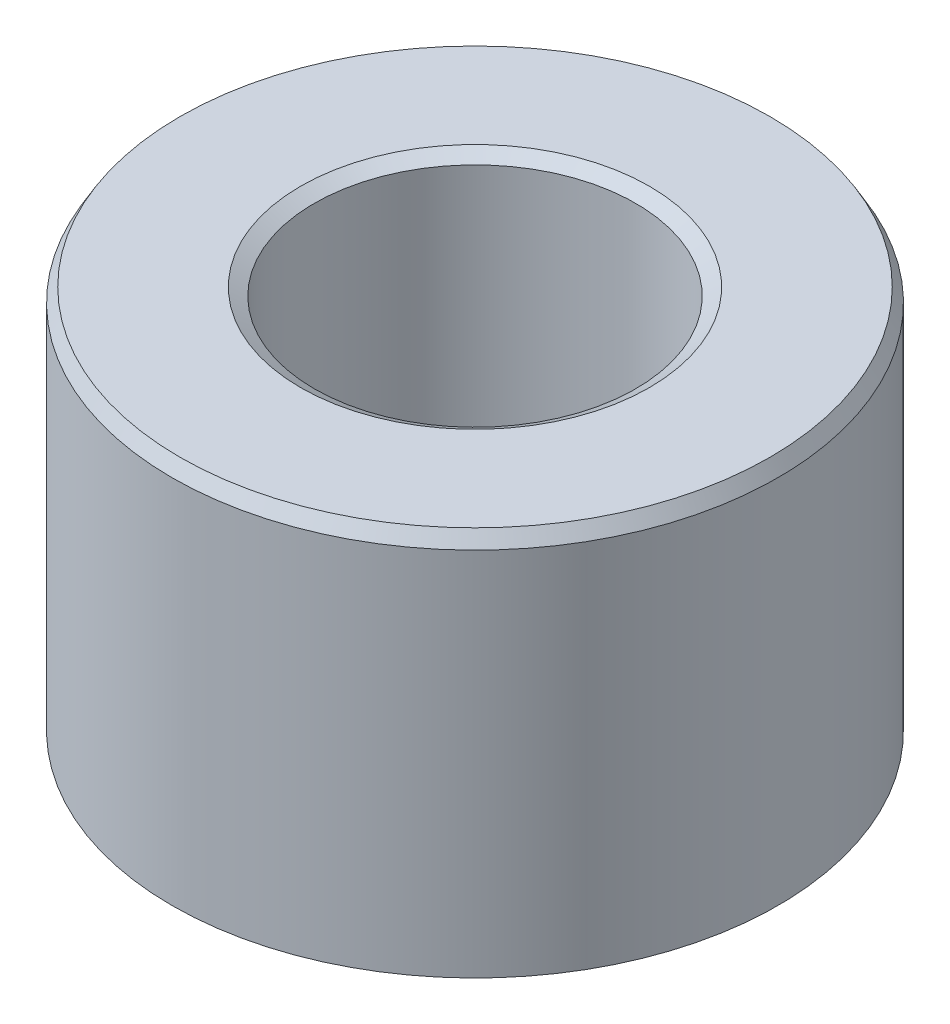
ISO-10303-21;
HEADER;
FILE_DESCRIPTION(('STEP AP214'),'2;1');
FILE_NAME('part.step','',(''),(''),'','','');
FILE_SCHEMA(('AUTOMOTIVE_DESIGN { 1 0 10303 214 1 1 1 1 }'));
ENDSEC;
DATA;
#1=APPLICATION_CONTEXT('core data for automotive mechanical design processes');
#2=APPLICATION_PROTOCOL_DEFINITION('international standard','automotive_design',2000,#1);
#3=PRODUCT_CONTEXT('',#1,'mechanical');
#4=PRODUCT('Part','Part','',(#3));
#5=PRODUCT_RELATED_PRODUCT_CATEGORY('part','',(#4));
#6=PRODUCT_DEFINITION_FORMATION('','',#4);
#7=PRODUCT_DEFINITION_CONTEXT('part definition',#1,'design');
#8=PRODUCT_DEFINITION('design','',#6,#7);
#9=PRODUCT_DEFINITION_SHAPE('','',#8);
#10=(LENGTH_UNIT() NAMED_UNIT(*) SI_UNIT(.MILLI.,.METRE.));
#11=(NAMED_UNIT(*) PLANE_ANGLE_UNIT() SI_UNIT($,.RADIAN.));
#12=(NAMED_UNIT(*) SI_UNIT($,.STERADIAN.) SOLID_ANGLE_UNIT());
#13=UNCERTAINTY_MEASURE_WITH_UNIT(LENGTH_MEASURE(1.E-05),#10,'distance_accuracy_value','');
#14=(GEOMETRIC_REPRESENTATION_CONTEXT(3) GLOBAL_UNCERTAINTY_ASSIGNED_CONTEXT((#13)) GLOBAL_UNIT_ASSIGNED_CONTEXT((#10,
#11,#12)) REPRESENTATION_CONTEXT('',''));
#15=CARTESIAN_POINT('',(0.,0.,0.));
#16=DIRECTION('',(0.,0.,1.));
#17=DIRECTION('',(1.,0.,0.));
#18=AXIS2_PLACEMENT_3D('',#15,#16,#17);
#19=CARTESIAN_POINT('',(0.,9.7087255560398,0.));
#20=DIRECTION('',(0.,-1.,0.));
#21=DIRECTION('',(0.,0.,-1.));
#22=AXIS2_PLACEMENT_3D('',#19,#20,#21);
#23=CYLINDRICAL_SURFACE('',#22,7.5);
#24=CARTESIAN_POINT('',(0.,0.196285721641992,0.));
#25=DIRECTION('',(0.,1.,0.));
#26=DIRECTION('',(0.,0.,1.));
#27=AXIS2_PLACEMENT_3D('',#24,#25,#26);
#28=CIRCLE('',#27,7.5);
#29=CARTESIAN_POINT('',(0.,0.196285721641992,7.5));
#30=VERTEX_POINT('',#29);
#31=EDGE_CURVE('E10',#30,#30,#28,.T.);
#32=ORIENTED_EDGE('',*,*,#31,.T.);
#33=EDGE_LOOP('',(#32));
#34=FACE_BOUND('',#33,.T.);
#35=CARTESIAN_POINT('',(0.,9.36874871335555,0.));
#36=DIRECTION('',(0.,1.,0.));
#37=DIRECTION('',(0.,0.,1.));
#38=AXIS2_PLACEMENT_3D('',#35,#36,#37);
#39=CIRCLE('',#38,7.5);
#40=CARTESIAN_POINT('',(0.,9.36874871335555,7.5));
#41=VERTEX_POINT('',#40);
#42=EDGE_CURVE('E50',#41,#41,#39,.F.);
#43=ORIENTED_EDGE('',*,*,#42,.T.);
#44=EDGE_LOOP('',(#43));
#45=FACE_BOUND('',#44,.T.);
#46=ADVANCED_FACE('F39',(#34,#45),#23,.T.);
#47=CARTESIAN_POINT('',(0.,9.7087255560398,0.));
#48=DIRECTION('',(0.,1.,0.));
#49=DIRECTION('',(0.,0.,1.));
#50=AXIS2_PLACEMENT_3D('',#47,#48,#49);
#51=PLANE('',#50);
#52=CARTESIAN_POINT('',(0.,9.7087255560398,0.));
#53=DIRECTION('',(0.,1.,0.));
#54=DIRECTION('',(0.,0.,1.));
#55=AXIS2_PLACEMENT_3D('',#52,#53,#54);
#56=CIRCLE('',#55,4.31771820686755);
#57=CARTESIAN_POINT('',(0.,9.7087255560398,4.31771820686755));
#58=VERTEX_POINT('',#57);
#59=EDGE_CURVE('E58',#58,#58,#56,.F.);
#60=ORIENTED_EDGE('',*,*,#59,.T.);
#61=EDGE_LOOP('',(#60));
#62=FACE_BOUND('',#61,.T.);
#63=CARTESIAN_POINT('',(0.,9.7087255560398,0.));
#64=DIRECTION('',(0.,1.,0.));
#65=DIRECTION('',(0.,0.,1.));
#66=AXIS2_PLACEMENT_3D('',#63,#64,#65);
#67=CIRCLE('',#66,7.30371427835801);
#68=CARTESIAN_POINT('',(0.,9.7087255560398,7.30371427835801));
#69=VERTEX_POINT('',#68);
#70=EDGE_CURVE('E61',#69,#69,#67,.T.);
#71=ORIENTED_EDGE('',*,*,#70,.T.);
#72=EDGE_LOOP('',(#71));
#73=FACE_BOUND('',#72,.T.);
#74=ADVANCED_FACE('F88',(#62,#73),#51,.T.);
#75=CARTESIAN_POINT('',(0.,0.,0.));
#76=DIRECTION('',(0.,1.,0.));
#77=DIRECTION('',(0.,0.,1.));
#78=AXIS2_PLACEMENT_3D('',#75,#76,#77);
#79=PLANE('',#78);
#80=CARTESIAN_POINT('',(0.,0.,0.));
#81=DIRECTION('',(0.,1.,0.));
#82=DIRECTION('',(0.,0.,1.));
#83=AXIS2_PLACEMENT_3D('',#80,#81,#82);
#84=CIRCLE('',#83,4.17402708582529);
#85=CARTESIAN_POINT('',(0.,0.,4.17402708582529));
#86=VERTEX_POINT('',#85);
#87=EDGE_CURVE('E51',#86,#86,#84,.T.);
#88=ORIENTED_EDGE('',*,*,#87,.T.);
#89=EDGE_LOOP('',(#88));
#90=FACE_BOUND('',#89,.T.);
#91=CARTESIAN_POINT('',(0.,0.,0.));
#92=DIRECTION('',(0.,1.,0.));
#93=DIRECTION('',(0.,0.,1.));
#94=AXIS2_PLACEMENT_3D('',#91,#92,#93);
#95=CIRCLE('',#94,7.16002315731575);
#96=CARTESIAN_POINT('',(0.,0.,7.16002315731575));
#97=VERTEX_POINT('',#96);
#98=EDGE_CURVE('E54',#97,#97,#95,.F.);
#99=ORIENTED_EDGE('',*,*,#98,.T.);
#100=EDGE_LOOP('',(#99));
#101=FACE_BOUND('',#100,.T.);
#102=ADVANCED_FACE('F83',(#90,#101),#79,.F.);
#103=CARTESIAN_POINT('',(0.,9.7087255560398,0.));
#104=DIRECTION('',(0.,-1.,0.));
#105=DIRECTION('',(0.,0.,-1.));
#106=AXIS2_PLACEMENT_3D('',#103,#104,#105);
#107=CYLINDRICAL_SURFACE('',#106,3.9777413641833);
#108=CARTESIAN_POINT('',(0.,9.51243983439781,0.));
#109=DIRECTION('',(0.,1.,0.));
#110=DIRECTION('',(0.,0.,1.));
#111=AXIS2_PLACEMENT_3D('',#108,#109,#110);
#112=CIRCLE('',#111,3.9777413641833);
#113=CARTESIAN_POINT('',(0.,9.51243983439781,3.9777413641833));
#114=VERTEX_POINT('',#113);
#115=EDGE_CURVE('E67',#114,#114,#112,.T.);
#116=ORIENTED_EDGE('',*,*,#115,.T.);
#117=EDGE_LOOP('',(#116));
#118=FACE_BOUND('',#117,.T.);
#119=CARTESIAN_POINT('',(0.,0.339976842684253,0.));
#120=DIRECTION('',(0.,1.,0.));
#121=DIRECTION('',(0.,0.,1.));
#122=AXIS2_PLACEMENT_3D('',#119,#120,#121);
#123=CIRCLE('',#122,3.9777413641833);
#124=CARTESIAN_POINT('',(0.,0.339976842684253,3.9777413641833));
#125=VERTEX_POINT('',#124);
#126=EDGE_CURVE('E69',#125,#125,#123,.F.);
#127=ORIENTED_EDGE('',*,*,#126,.T.);
#128=EDGE_LOOP('',(#127));
#129=FACE_BOUND('',#128,.T.);
#130=ADVANCED_FACE('F71',(#118,#129),#107,.F.);
#131=CARTESIAN_POINT('',(0.,9.51243983439781,0.));
#132=DIRECTION('',(0.,1.,0.));
#133=DIRECTION('',(0.,0.,1.));
#134=AXIS2_PLACEMENT_3D('',#131,#132,#133);
#135=CONICAL_SURFACE('',#134,3.9777413641833,1.0471975511966);
#136=ORIENTED_EDGE('',*,*,#59,.F.);
#137=EDGE_LOOP('',(#136));
#138=FACE_BOUND('',#137,.T.);
#139=ORIENTED_EDGE('',*,*,#115,.F.);
#140=EDGE_LOOP('',(#139));
#141=FACE_BOUND('',#140,.T.);
#142=ADVANCED_FACE('F77',(#138,#141),#135,.F.);
#143=CARTESIAN_POINT('',(0.,0.,0.));
#144=DIRECTION('',(0.,-1.,0.));
#145=DIRECTION('',(0.,0.,-1.));
#146=AXIS2_PLACEMENT_3D('',#143,#144,#145);
#147=CONICAL_SURFACE('',#146,4.17402708582529,0.523598775598296);
#148=ORIENTED_EDGE('',*,*,#126,.F.);
#149=EDGE_LOOP('',(#148));
#150=FACE_BOUND('',#149,.T.);
#151=ORIENTED_EDGE('',*,*,#87,.F.);
#152=EDGE_LOOP('',(#151));
#153=FACE_BOUND('',#152,.T.);
#154=ADVANCED_FACE('F73',(#150,#153),#147,.F.);
#155=CARTESIAN_POINT('',(0.,0.196285721641992,0.));
#156=DIRECTION('',(0.,1.,0.));
#157=DIRECTION('',(0.,0.,1.));
#158=AXIS2_PLACEMENT_3D('',#155,#156,#157);
#159=CONICAL_SURFACE('',#158,7.5,1.0471975511966);
#160=CARTESIAN_POINT('',(0.,0.,7.16002315731575));
#161=CARTESIAN_POINT('',(0.,0.00204464293377064,7.16356458276037));
#162=CARTESIAN_POINT('',(0.,0.00408928586754143,7.167106008205));
#163=CARTESIAN_POINT('',(0.,0.00817857173508301,7.17418885909426));
#164=CARTESIAN_POINT('',(0.,0.0102232146688538,7.17773028453888));
#165=CARTESIAN_POINT('',(0.,0.0143125005363953,7.18481313542814));
#166=CARTESIAN_POINT('',(0.,0.0163571434701659,7.18835456087277));
#167=CARTESIAN_POINT('',(0.,0.0204464293377074,7.19543741176202));
#168=CARTESIAN_POINT('',(0.,0.0224910722714782,7.19897883720665));
#169=CARTESIAN_POINT('',(0.,0.0265803581390197,7.2060616880959));
#170=CARTESIAN_POINT('',(0.,0.0286250010727904,7.20960311354053));
#171=CARTESIAN_POINT('',(0.,0.032714286940332,7.21668596442979));
#172=CARTESIAN_POINT('',(0.,0.0347589298741028,7.22022738987441));
#173=CARTESIAN_POINT('',(0.,0.0388482157416442,7.22731024076367));
#174=CARTESIAN_POINT('',(0.,0.0408928586754149,7.2308516662083));
#175=CARTESIAN_POINT('',(0.,0.0449821445429564,7.23793451709755));
#176=CARTESIAN_POINT('',(0.,0.0470267874767272,7.24147594254218));
#177=CARTESIAN_POINT('',(0.,0.0511160733442687,7.24855879343144));
#178=CARTESIAN_POINT('',(0.,0.0531607162780394,7.25210021887606));
#179=CARTESIAN_POINT('',(0.,0.057250002145581,7.25918306976532));
#180=CARTESIAN_POINT('',(0.,0.0592946450793518,7.26272449520995));
#181=CARTESIAN_POINT('',(0.,0.0633839309468932,7.2698073460992));
#182=CARTESIAN_POINT('',(0.,0.0654285738806639,7.27334877154383));
#183=CARTESIAN_POINT('',(0.,0.0695178597482053,7.28043162243309));
#184=CARTESIAN_POINT('',(0.,0.0715625026819762,7.28397304787771));
#185=CARTESIAN_POINT('',(0.,0.0756517885495177,7.29105589876697));
#186=CARTESIAN_POINT('',(0.,0.0776964314832884,7.2945973242116));
#187=CARTESIAN_POINT('',(0.,0.0817857173508299,7.30168017510085));
#188=CARTESIAN_POINT('',(0.,0.0838303602846008,7.30522160054548));
#189=CARTESIAN_POINT('',(0.,0.0879196461521422,7.31230445143473));
#190=CARTESIAN_POINT('',(0.,0.0899642890859129,7.31584587687936));
#191=CARTESIAN_POINT('',(0.,0.0940535749534543,7.32292872776862));
#192=CARTESIAN_POINT('',(0.,0.0960982178872252,7.32647015321325));
#193=CARTESIAN_POINT('',(0.,0.100187503754767,7.3335530041025));
#194=CARTESIAN_POINT('',(0.,0.102232146688537,7.33709442954713));
#195=CARTESIAN_POINT('',(0.,0.106321432556079,7.34417728043638));
#196=CARTESIAN_POINT('',(0.,0.10836607548985,7.34771870588101));
#197=CARTESIAN_POINT('',(0.,0.112455361357391,7.35480155677027));
#198=CARTESIAN_POINT('',(0.,0.114500004291162,7.35834298221489));
#199=CARTESIAN_POINT('',(0.,0.118589290158703,7.36542583310415));
#200=CARTESIAN_POINT('',(0.,0.120633933092474,7.36896725854878));
#201=CARTESIAN_POINT('',(0.,0.124723218960016,7.37605010943803));
#202=CARTESIAN_POINT('',(0.,0.126767861893786,7.37959153488266));
#203=CARTESIAN_POINT('',(0.,0.130857147761328,7.38667438577192));
#204=CARTESIAN_POINT('',(0.,0.132901790695099,7.39021581121654));
#205=CARTESIAN_POINT('',(0.,0.13699107656264,7.3972986621058));
#206=CARTESIAN_POINT('',(0.,0.139035719496411,7.40084008755043));
#207=CARTESIAN_POINT('',(0.,0.143125005363952,7.40792293843968));
#208=CARTESIAN_POINT('',(0.,0.145169648297723,7.41146436388431));
#209=CARTESIAN_POINT('',(0.,0.149258934165265,7.41854721477356));
#210=CARTESIAN_POINT('',(0.,0.151303577099035,7.42208864021819));
#211=CARTESIAN_POINT('',(0.,0.155392862966577,7.42917149110745));
#212=CARTESIAN_POINT('',(0.,0.157437505900348,7.43271291655207));
#213=CARTESIAN_POINT('',(0.,0.161526791767889,7.43979576744133));
#214=CARTESIAN_POINT('',(0.,0.16357143470166,7.44333719288596));
#215=CARTESIAN_POINT('',(0.,0.167660720569201,7.45042004377521));
#216=CARTESIAN_POINT('',(0.,0.169705363502972,7.45396146921984));
#217=CARTESIAN_POINT('',(0.,0.173794649370514,7.4610443201091));
#218=CARTESIAN_POINT('',(0.,0.175839292304284,7.46458574555372));
#219=CARTESIAN_POINT('',(0.,0.179928578171826,7.47166859644298));
#220=CARTESIAN_POINT('',(0.,0.181973221105597,7.47521002188761));
#221=CARTESIAN_POINT('',(0.,0.186062506973138,7.48229287277686));
#222=CARTESIAN_POINT('',(0.,0.188107149906909,7.48583429822149));
#223=CARTESIAN_POINT('',(0.,0.19219643577445,7.49291714911074));
#224=CARTESIAN_POINT('',(0.,0.194241078708221,7.49645857455537));
#225=CARTESIAN_POINT('',(0.,0.196285721641992,7.5));
#226=B_SPLINE_CURVE_WITH_KNOTS('',3,(#160,#161,#162,#163,#164,#165,#166,#167,#168,#169,#170,
#171,#172,#173,#174,#175,#176,#177,#178,#179,#180,#181,#182,#183,#184,#185,#186,#187,#188,#189,
#190,#191,#192,#193,#194,#195,#196,#197,#198,#199,#200,#201,#202,#203,#204,#205,#206,#207,#208,
#209,#210,#211,#212,#213,#214,#215,#216,#217,#218,#219,#220,#221,#222,#223,#224,#225),
.UNSPECIFIED.,.F.,.F.,(4,2,2,2,2,2,2,2,2,2,2,2,2,2,2,2,2,2,2,2,2,2,2,2,2,2,2,2,2,2,2,2,4),(0.,
0.0122678576026244,0.0245357152052487,0.0368035728078739,0.0490714304104983,0.0613392880131226,
0.073607145615747,0.0858750032183721,0.0981428608209965,0.110410718423621,0.122678576026245,
0.13494643362887,0.147214291231495,0.159482148834119,0.171750006436743,0.184017864039369,
0.196285721641993,0.208553579244617,0.220821436847242,0.233089294449867,0.245357152052491,
0.257625009655116,0.26989286725774,0.282160724860365,0.294428582462989,0.306696440065614,
0.318964297668238,0.331232155270863,0.343500012873488,0.355767870476112,0.368035728078737,
0.380303585681362,0.392571443283986),.UNSPECIFIED.);
#227=EDGE_CURVE('BSEAM76',#97,#30,#226,.T.);
#228=ORIENTED_EDGE('',*,*,#98,.F.);
#229=ORIENTED_EDGE('',*,*,#31,.F.);
#230=ORIENTED_EDGE('',*,*,#227,.T.);
#231=ORIENTED_EDGE('',*,*,#227,.F.);
#232=EDGE_LOOP('',(#228,#230,#229,#231));
#233=FACE_BOUND('',#232,.T.);
#234=ADVANCED_FACE('F76',(#233),#159,.T.);
#235=CARTESIAN_POINT('',(0.,9.7087255560398,0.));
#236=DIRECTION('',(0.,-1.,0.));
#237=DIRECTION('',(0.,0.,-1.));
#238=AXIS2_PLACEMENT_3D('',#235,#236,#237);
#239=CONICAL_SURFACE('',#238,7.30371427835801,0.523598775598299);
#240=ORIENTED_EDGE('',*,*,#42,.F.);
#241=EDGE_LOOP('',(#240));
#242=FACE_BOUND('',#241,.T.);
#243=ORIENTED_EDGE('',*,*,#70,.F.);
#244=EDGE_LOOP('',(#243));
#245=FACE_BOUND('',#244,.T.);
#246=ADVANCED_FACE('F45',(#242,#245),#239,.T.);
#247=CLOSED_SHELL('',(#46,#74,#102,#130,#142,#154,#234,#246));
#248=MANIFOLD_SOLID_BREP('B2',#247);
#249=ADVANCED_BREP_SHAPE_REPRESENTATION('',(#18,#248),#14);
#250=SHAPE_DEFINITION_REPRESENTATION(#9,#249);
ENDSEC;
END-ISO-10303-21;
